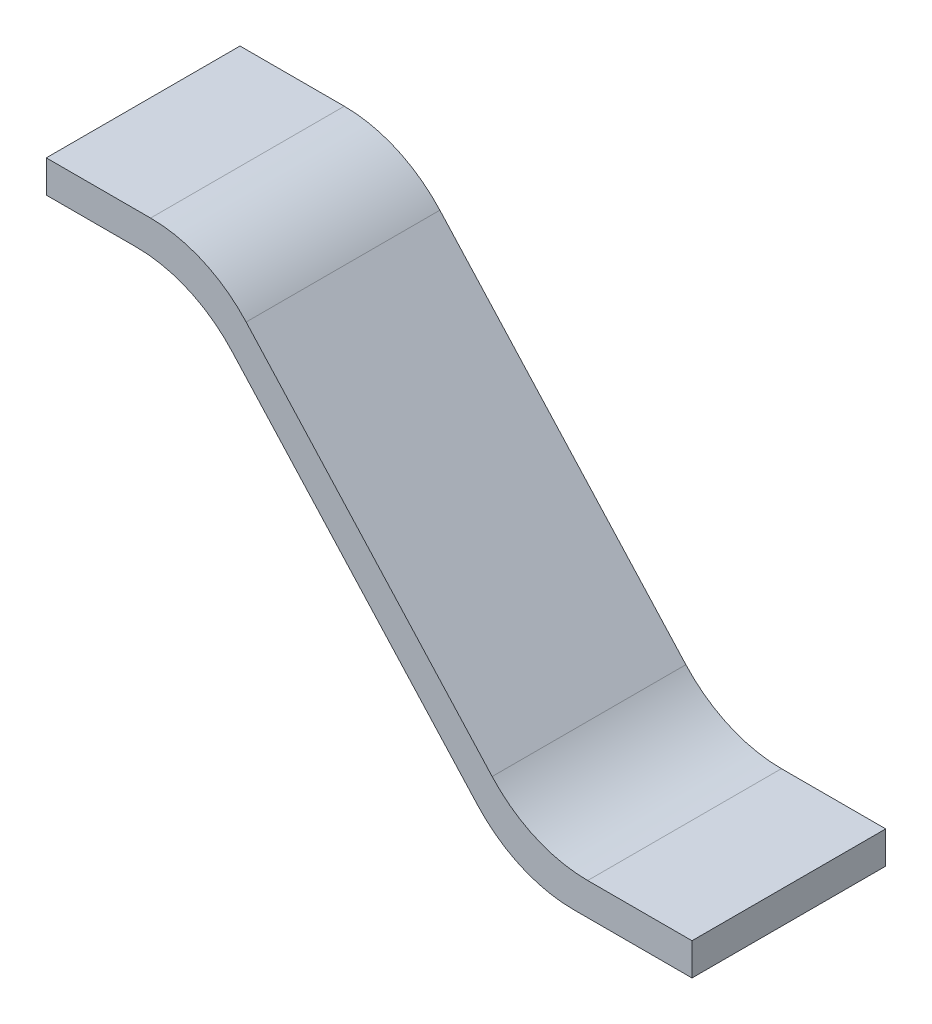
ISO-10303-21;
HEADER;
FILE_DESCRIPTION(('STEP AP214'),'2;1');
FILE_NAME('part.step','',(''),(''),'','','');
FILE_SCHEMA(('AUTOMOTIVE_DESIGN { 1 0 10303 214 1 1 1 1 }'));
ENDSEC;
DATA;
#1=APPLICATION_CONTEXT('core data for automotive mechanical design processes');
#2=APPLICATION_PROTOCOL_DEFINITION('international standard','automotive_design',2000,#1);
#3=PRODUCT_CONTEXT('',#1,'mechanical');
#4=PRODUCT('Part','Part','',(#3));
#5=PRODUCT_RELATED_PRODUCT_CATEGORY('part','',(#4));
#6=PRODUCT_DEFINITION_FORMATION('','',#4);
#7=PRODUCT_DEFINITION_CONTEXT('part definition',#1,'design');
#8=PRODUCT_DEFINITION('design','',#6,#7);
#9=PRODUCT_DEFINITION_SHAPE('','',#8);
#10=(LENGTH_UNIT() NAMED_UNIT(*) SI_UNIT(.MILLI.,.METRE.));
#11=(NAMED_UNIT(*) PLANE_ANGLE_UNIT() SI_UNIT($,.RADIAN.));
#12=(NAMED_UNIT(*) SI_UNIT($,.STERADIAN.) SOLID_ANGLE_UNIT());
#13=UNCERTAINTY_MEASURE_WITH_UNIT(LENGTH_MEASURE(1.E-05),#10,'distance_accuracy_value','');
#14=(GEOMETRIC_REPRESENTATION_CONTEXT(3) GLOBAL_UNCERTAINTY_ASSIGNED_CONTEXT((#13)) GLOBAL_UNIT_ASSIGNED_CONTEXT((#10,
#11,#12)) REPRESENTATION_CONTEXT('',''));
#15=CARTESIAN_POINT('',(0.,0.,0.));
#16=DIRECTION('',(0.,0.,1.));
#17=DIRECTION('',(1.,0.,0.));
#18=AXIS2_PLACEMENT_3D('',#15,#16,#17);
#19=CARTESIAN_POINT('',(0.,-0.05,0.15));
#20=DIRECTION('',(1.,0.,0.));
#21=DIRECTION('',(0.,0.,-1.));
#22=AXIS2_PLACEMENT_3D('',#19,#20,#21);
#23=PLANE('',#22);
#24=DIRECTION('',(0.,-1.,0.));
#25=VECTOR('',#24,1.);
#26=CARTESIAN_POINT('',(0.,-0.05,-0.15));
#27=LINE('',#26,#25);
#28=CARTESIAN_POINT('',(0.,0.,-0.15));
#29=VERTEX_POINT('',#28);
#30=CARTESIAN_POINT('',(0.,-0.05,-0.15));
#31=VERTEX_POINT('',#30);
#32=EDGE_CURVE('E147',#29,#31,#27,.T.);
#33=ORIENTED_EDGE('',*,*,#32,.T.);
#34=DIRECTION('',(0.,0.,-1.));
#35=VECTOR('',#34,1.);
#36=CARTESIAN_POINT('',(0.,-0.05,0.15));
#37=LINE('',#36,#35);
#38=CARTESIAN_POINT('',(0.,-0.05,0.15));
#39=VERTEX_POINT('',#38);
#40=EDGE_CURVE('E129',#39,#31,#37,.T.);
#41=ORIENTED_EDGE('',*,*,#40,.F.);
#42=DIRECTION('',(0.,-1.,0.));
#43=VECTOR('',#42,1.);
#44=CARTESIAN_POINT('',(0.,-0.05,0.15));
#45=LINE('',#44,#43);
#46=CARTESIAN_POINT('',(0.,0.,0.15));
#47=VERTEX_POINT('',#46);
#48=EDGE_CURVE('E135',#47,#39,#45,.T.);
#49=ORIENTED_EDGE('',*,*,#48,.F.);
#50=DIRECTION('',(0.,0.,-1.));
#51=VECTOR('',#50,1.);
#52=CARTESIAN_POINT('',(0.,0.,0.15));
#53=LINE('',#52,#51);
#54=EDGE_CURVE('E209',#47,#29,#53,.T.);
#55=ORIENTED_EDGE('',*,*,#54,.T.);
#56=EDGE_LOOP('',(#33,#41,#49,#55));
#57=FACE_BOUND('',#56,.T.);
#58=ADVANCED_FACE('F34',(#57),#23,.F.);
#59=CARTESIAN_POINT('',(0.,-0.05,0.15));
#60=DIRECTION('',(0.,1.,0.));
#61=DIRECTION('',(0.,0.,1.));
#62=AXIS2_PLACEMENT_3D('',#59,#60,#61);
#63=PLANE('',#62);
#64=DIRECTION('',(1.,0.,0.));
#65=VECTOR('',#64,1.);
#66=CARTESIAN_POINT('',(0.,-0.05,-0.15));
#67=LINE('',#66,#65);
#68=CARTESIAN_POINT('',(0.139407528470034,-0.05,-0.15));
#69=VERTEX_POINT('',#68);
#70=EDGE_CURVE('E216',#31,#69,#67,.T.);
#71=ORIENTED_EDGE('',*,*,#70,.T.);
#72=DIRECTION('',(0.,0.,-1.));
#73=VECTOR('',#72,1.);
#74=CARTESIAN_POINT('',(0.139407528470034,-0.05,0.15));
#75=LINE('',#74,#73);
#76=CARTESIAN_POINT('',(0.139407528470034,-0.05,0.15));
#77=VERTEX_POINT('',#76);
#78=EDGE_CURVE('E132',#69,#77,#75,.F.);
#79=ORIENTED_EDGE('',*,*,#78,.T.);
#80=DIRECTION('',(1.,0.,0.));
#81=VECTOR('',#80,1.);
#82=CARTESIAN_POINT('',(0.,-0.05,0.15));
#83=LINE('',#82,#81);
#84=EDGE_CURVE('E124',#39,#77,#83,.T.);
#85=ORIENTED_EDGE('',*,*,#84,.F.);
#86=ORIENTED_EDGE('',*,*,#40,.T.);
#87=EDGE_LOOP('',(#71,#79,#85,#86));
#88=FACE_BOUND('',#87,.T.);
#89=ADVANCED_FACE('F127',(#88),#63,.F.);
#90=CARTESIAN_POINT('',(0.227881505694007,-0.05,0.15));
#91=DIRECTION('',(0.739940073395944,0.672672793996313,0.));
#92=DIRECTION('',(-0.672672793996313,0.739940073395944,0.));
#93=AXIS2_PLACEMENT_3D('',#90,#91,#92);
#94=PLANE('',#93);
#95=DIRECTION('',(0.672672793996313,-0.739940073395944,0.));
#96=VECTOR('',#95,1.);
#97=CARTESIAN_POINT('',(0.227881505694007,-0.05,0.15));
#98=LINE('',#97,#96);
#99=CARTESIAN_POINT('',(0.287395543149223,-0.115465441200738,0.15));
#100=VERTEX_POINT('',#99);
#101=CARTESIAN_POINT('',(0.668367468238791,-0.534534558799262,0.15));
#102=VERTEX_POINT('',#101);
#103=EDGE_CURVE('E134',#100,#102,#98,.T.);
#104=ORIENTED_EDGE('',*,*,#103,.F.);
#105=DIRECTION('',(0.,0.,-1.));
#106=VECTOR('',#105,1.);
#107=CARTESIAN_POINT('',(0.287395543149223,-0.115465441200738,-0.15));
#108=LINE('',#107,#106);
#109=CARTESIAN_POINT('',(0.287395543149223,-0.115465441200738,-0.15));
#110=VERTEX_POINT('',#109);
#111=EDGE_CURVE('E151',#100,#110,#108,.T.);
#112=ORIENTED_EDGE('',*,*,#111,.T.);
#113=DIRECTION('',(0.672672793996313,-0.739940073395944,0.));
#114=VECTOR('',#113,1.);
#115=CARTESIAN_POINT('',(0.227881505694007,-0.05,-0.15));
#116=LINE('',#115,#114);
#117=CARTESIAN_POINT('',(0.668367468238791,-0.534534558799262,-0.15));
#118=VERTEX_POINT('',#117);
#119=EDGE_CURVE('E218',#110,#118,#116,.T.);
#120=ORIENTED_EDGE('',*,*,#119,.T.);
#121=DIRECTION('',(0.,0.,-1.));
#122=VECTOR('',#121,1.);
#123=CARTESIAN_POINT('',(0.668367468238791,-0.534534558799262,0.15));
#124=LINE('',#123,#122);
#125=EDGE_CURVE('E148',#118,#102,#124,.F.);
#126=ORIENTED_EDGE('',*,*,#125,.T.);
#127=EDGE_LOOP('',(#104,#112,#120,#126));
#128=FACE_BOUND('',#127,.T.);
#129=ADVANCED_FACE('F235',(#128),#94,.F.);
#130=CARTESIAN_POINT('',(0.727881505694007,-0.6,0.15));
#131=DIRECTION('',(0.,1.,0.));
#132=DIRECTION('',(0.,0.,1.));
#133=AXIS2_PLACEMENT_3D('',#130,#131,#132);
#134=PLANE('',#133);
#135=DIRECTION('',(1.,0.,0.));
#136=VECTOR('',#135,1.);
#137=CARTESIAN_POINT('',(0.727881505694007,-0.6,0.15));
#138=LINE('',#137,#136);
#139=CARTESIAN_POINT('',(0.81635548291798,-0.6,0.15));
#140=VERTEX_POINT('',#139);
#141=CARTESIAN_POINT('',(1.,-0.6,0.15));
#142=VERTEX_POINT('',#141);
#143=EDGE_CURVE('E237',#140,#142,#138,.T.);
#144=ORIENTED_EDGE('',*,*,#143,.F.);
#145=DIRECTION('',(0.,0.,-1.));
#146=VECTOR('',#145,1.);
#147=CARTESIAN_POINT('',(0.81635548291798,-0.6,0.15));
#148=LINE('',#147,#146);
#149=CARTESIAN_POINT('',(0.81635548291798,-0.6,-0.15));
#150=VERTEX_POINT('',#149);
#151=EDGE_CURVE('E161',#140,#150,#148,.T.);
#152=ORIENTED_EDGE('',*,*,#151,.T.);
#153=DIRECTION('',(1.,0.,0.));
#154=VECTOR('',#153,1.);
#155=CARTESIAN_POINT('',(0.727881505694007,-0.6,-0.15));
#156=LINE('',#155,#154);
#157=CARTESIAN_POINT('',(1.,-0.6,-0.15));
#158=VERTEX_POINT('',#157);
#159=EDGE_CURVE('E221',#150,#158,#156,.T.);
#160=ORIENTED_EDGE('',*,*,#159,.T.);
#161=DIRECTION('',(0.,0.,-1.));
#162=VECTOR('',#161,1.);
#163=CARTESIAN_POINT('',(1.,-0.6,0.15));
#164=LINE('',#163,#162);
#165=EDGE_CURVE('E149',#142,#158,#164,.T.);
#166=ORIENTED_EDGE('',*,*,#165,.F.);
#167=EDGE_LOOP('',(#144,#152,#160,#166));
#168=FACE_BOUND('',#167,.T.);
#169=ADVANCED_FACE('F246',(#168),#134,.F.);
#170=CARTESIAN_POINT('',(1.,-0.6,0.15));
#171=DIRECTION('',(-1.,0.,0.));
#172=DIRECTION('',(0.,0.,1.));
#173=AXIS2_PLACEMENT_3D('',#170,#171,#172);
#174=PLANE('',#173);
#175=DIRECTION('',(0.,1.,0.));
#176=VECTOR('',#175,1.);
#177=CARTESIAN_POINT('',(1.,-0.6,-0.15));
#178=LINE('',#177,#176);
#179=CARTESIAN_POINT('',(1.,-0.55,-0.15));
#180=VERTEX_POINT('',#179);
#181=EDGE_CURVE('E201',#158,#180,#178,.T.);
#182=ORIENTED_EDGE('',*,*,#181,.T.);
#183=DIRECTION('',(0.,0.,-1.));
#184=VECTOR('',#183,1.);
#185=CARTESIAN_POINT('',(1.,-0.55,0.15));
#186=LINE('',#185,#184);
#187=CARTESIAN_POINT('',(1.,-0.55,0.15));
#188=VERTEX_POINT('',#187);
#189=EDGE_CURVE('E154',#188,#180,#186,.T.);
#190=ORIENTED_EDGE('',*,*,#189,.F.);
#191=DIRECTION('',(0.,1.,0.));
#192=VECTOR('',#191,1.);
#193=CARTESIAN_POINT('',(1.,-0.6,0.15));
#194=LINE('',#193,#192);
#195=EDGE_CURVE('E211',#142,#188,#194,.T.);
#196=ORIENTED_EDGE('',*,*,#195,.F.);
#197=ORIENTED_EDGE('',*,*,#165,.T.);
#198=EDGE_LOOP('',(#182,#190,#196,#197));
#199=FACE_BOUND('',#198,.T.);
#200=ADVANCED_FACE('F244',(#199),#174,.F.);
#201=CARTESIAN_POINT('',(0.75,-0.55,0.15));
#202=DIRECTION('',(0.,-1.,0.));
#203=DIRECTION('',(0.,0.,-1.));
#204=AXIS2_PLACEMENT_3D('',#201,#202,#203);
#205=PLANE('',#204);
#206=DIRECTION('',(-1.,0.,0.));
#207=VECTOR('',#206,1.);
#208=CARTESIAN_POINT('',(0.75,-0.55,-0.15));
#209=LINE('',#208,#207);
#210=CARTESIAN_POINT('',(0.838473977223973,-0.55,-0.15));
#211=VERTEX_POINT('',#210);
#212=EDGE_CURVE('E190',#180,#211,#209,.T.);
#213=ORIENTED_EDGE('',*,*,#212,.T.);
#214=DIRECTION('',(0.,0.,-1.));
#215=VECTOR('',#214,1.);
#216=CARTESIAN_POINT('',(0.838473977223973,-0.55,0.15));
#217=LINE('',#216,#215);
#218=CARTESIAN_POINT('',(0.838473977223973,-0.55,0.15));
#219=VERTEX_POINT('',#218);
#220=EDGE_CURVE('E175',#211,#219,#217,.F.);
#221=ORIENTED_EDGE('',*,*,#220,.T.);
#222=DIRECTION('',(-1.,0.,0.));
#223=VECTOR('',#222,1.);
#224=CARTESIAN_POINT('',(0.75,-0.55,0.15));
#225=LINE('',#224,#223);
#226=EDGE_CURVE('E206',#188,#219,#225,.T.);
#227=ORIENTED_EDGE('',*,*,#226,.F.);
#228=ORIENTED_EDGE('',*,*,#189,.T.);
#229=EDGE_LOOP('',(#213,#221,#227,#228));
#230=FACE_BOUND('',#229,.T.);
#231=ADVANCED_FACE('F197',(#230),#205,.F.);
#232=CARTESIAN_POINT('',(0.25,0.,0.15));
#233=DIRECTION('',(-0.739940073395944,-0.672672793996313,0.));
#234=DIRECTION('',(0.672672793996313,-0.739940073395944,0.));
#235=AXIS2_PLACEMENT_3D('',#232,#233,#234);
#236=PLANE('',#235);
#237=DIRECTION('',(-0.672672793996313,0.739940073395944,0.));
#238=VECTOR('',#237,1.);
#239=CARTESIAN_POINT('',(0.25,0.,0.15));
#240=LINE('',#239,#238);
#241=CARTESIAN_POINT('',(0.690485962544784,-0.484534558799263,0.15));
#242=VERTEX_POINT('',#241);
#243=CARTESIAN_POINT('',(0.309514037455216,-0.0654654412007375,0.15));
#244=VERTEX_POINT('',#243);
#245=EDGE_CURVE('E205',#242,#244,#240,.T.);
#246=ORIENTED_EDGE('',*,*,#245,.F.);
#247=DIRECTION('',(0.,0.,-1.));
#248=VECTOR('',#247,1.);
#249=CARTESIAN_POINT('',(0.690485962544784,-0.484534558799262,-0.15));
#250=LINE('',#249,#248);
#251=CARTESIAN_POINT('',(0.690485962544784,-0.484534558799263,-0.15));
#252=VERTEX_POINT('',#251);
#253=EDGE_CURVE('E172',#242,#252,#250,.T.);
#254=ORIENTED_EDGE('',*,*,#253,.T.);
#255=DIRECTION('',(-0.672672793996313,0.739940073395944,0.));
#256=VECTOR('',#255,1.);
#257=CARTESIAN_POINT('',(0.25,0.,-0.15));
#258=LINE('',#257,#256);
#259=CARTESIAN_POINT('',(0.309514037455216,-0.0654654412007375,-0.15));
#260=VERTEX_POINT('',#259);
#261=EDGE_CURVE('E191',#252,#260,#258,.T.);
#262=ORIENTED_EDGE('',*,*,#261,.T.);
#263=DIRECTION('',(0.,0.,-1.));
#264=VECTOR('',#263,1.);
#265=CARTESIAN_POINT('',(0.309514037455216,-0.0654654412007375,0.15));
#266=LINE('',#265,#264);
#267=EDGE_CURVE('E57',#260,#244,#266,.F.);
#268=ORIENTED_EDGE('',*,*,#267,.T.);
#269=EDGE_LOOP('',(#246,#254,#262,#268));
#270=FACE_BOUND('',#269,.T.);
#271=ADVANCED_FACE('F207',(#270),#236,.F.);
#272=CARTESIAN_POINT('',(0.,0.,0.15));
#273=DIRECTION('',(0.,-1.,0.));
#274=DIRECTION('',(0.,0.,-1.));
#275=AXIS2_PLACEMENT_3D('',#272,#273,#274);
#276=PLANE('',#275);
#277=DIRECTION('',(-1.,0.,0.));
#278=VECTOR('',#277,1.);
#279=CARTESIAN_POINT('',(0.,0.,0.15));
#280=LINE('',#279,#278);
#281=CARTESIAN_POINT('',(0.161526022776027,0.,0.15));
#282=VERTEX_POINT('',#281);
#283=EDGE_CURVE('E140',#282,#47,#280,.T.);
#284=ORIENTED_EDGE('',*,*,#283,.F.);
#285=DIRECTION('',(0.,0.,-1.));
#286=VECTOR('',#285,1.);
#287=CARTESIAN_POINT('',(0.161526022776027,0.,0.15));
#288=LINE('',#287,#286);
#289=CARTESIAN_POINT('',(0.161526022776027,0.,-0.15));
#290=VERTEX_POINT('',#289);
#291=EDGE_CURVE('E177',#282,#290,#288,.T.);
#292=ORIENTED_EDGE('',*,*,#291,.T.);
#293=DIRECTION('',(-1.,0.,0.));
#294=VECTOR('',#293,1.);
#295=CARTESIAN_POINT('',(0.,0.,-0.15));
#296=LINE('',#295,#294);
#297=EDGE_CURVE('E144',#290,#29,#296,.T.);
#298=ORIENTED_EDGE('',*,*,#297,.T.);
#299=ORIENTED_EDGE('',*,*,#54,.F.);
#300=EDGE_LOOP('',(#284,#292,#298,#299));
#301=FACE_BOUND('',#300,.T.);
#302=ADVANCED_FACE('F274',(#301),#276,.F.);
#303=CARTESIAN_POINT('',(0.,0.,0.15));
#304=DIRECTION('',(0.,0.,-1.));
#305=DIRECTION('',(-1.,0.,0.));
#306=AXIS2_PLACEMENT_3D('',#303,#304,#305);
#307=PLANE('',#306);
#308=ORIENTED_EDGE('',*,*,#103,.T.);
#309=CARTESIAN_POINT('',(0.81635548291798,-0.4,0.15));
#310=DIRECTION('',(0.,0.,-1.));
#311=DIRECTION('',(-1.,0.,0.));
#312=AXIS2_PLACEMENT_3D('',#309,#310,#311);
#313=CIRCLE('',#312,0.2);
#314=EDGE_CURVE('E169',#102,#140,#313,.F.);
#315=ORIENTED_EDGE('',*,*,#314,.T.);
#316=ORIENTED_EDGE('',*,*,#143,.T.);
#317=ORIENTED_EDGE('',*,*,#195,.T.);
#318=ORIENTED_EDGE('',*,*,#226,.T.);
#319=CARTESIAN_POINT('',(0.838473977223973,-0.35,0.15));
#320=DIRECTION('',(0.,0.,-1.));
#321=DIRECTION('',(-1.,0.,0.));
#322=AXIS2_PLACEMENT_3D('',#319,#320,#321);
#323=CIRCLE('',#322,0.2);
#324=EDGE_CURVE('E11',#219,#242,#323,.T.);
#325=ORIENTED_EDGE('',*,*,#324,.T.);
#326=ORIENTED_EDGE('',*,*,#245,.T.);
#327=CARTESIAN_POINT('',(0.161526022776027,-0.2,0.15));
#328=DIRECTION('',(0.,0.,-1.));
#329=DIRECTION('',(-1.,0.,0.));
#330=AXIS2_PLACEMENT_3D('',#327,#328,#329);
#331=CIRCLE('',#330,0.2);
#332=EDGE_CURVE('E49',#244,#282,#331,.F.);
#333=ORIENTED_EDGE('',*,*,#332,.T.);
#334=ORIENTED_EDGE('',*,*,#283,.T.);
#335=ORIENTED_EDGE('',*,*,#48,.T.);
#336=ORIENTED_EDGE('',*,*,#84,.T.);
#337=CARTESIAN_POINT('',(0.139407528470034,-0.25,0.15));
#338=DIRECTION('',(0.,0.,-1.));
#339=DIRECTION('',(-1.,0.,0.));
#340=AXIS2_PLACEMENT_3D('',#337,#338,#339);
#341=CIRCLE('',#340,0.2);
#342=EDGE_CURVE('E182',#77,#100,#341,.T.);
#343=ORIENTED_EDGE('',*,*,#342,.T.);
#344=EDGE_LOOP('',(#308,#315,#316,#317,#318,#325,#326,#333,#334,#335,#336,#343));
#345=FACE_BOUND('',#344,.T.);
#346=ADVANCED_FACE('F139',(#345),#307,.F.);
#347=CARTESIAN_POINT('',(0.,0.,-0.15));
#348=DIRECTION('',(0.,0.,-1.));
#349=DIRECTION('',(-1.,0.,0.));
#350=AXIS2_PLACEMENT_3D('',#347,#348,#349);
#351=PLANE('',#350);
#352=ORIENTED_EDGE('',*,*,#159,.F.);
#353=CARTESIAN_POINT('',(0.81635548291798,-0.4,-0.15));
#354=DIRECTION('',(0.,0.,-1.));
#355=DIRECTION('',(-1.,0.,0.));
#356=AXIS2_PLACEMENT_3D('',#353,#354,#355);
#357=CIRCLE('',#356,0.2);
#358=EDGE_CURVE('E166',#150,#118,#357,.T.);
#359=ORIENTED_EDGE('',*,*,#358,.T.);
#360=ORIENTED_EDGE('',*,*,#119,.F.);
#361=CARTESIAN_POINT('',(0.139407528470034,-0.25,-0.15));
#362=DIRECTION('',(0.,0.,-1.));
#363=DIRECTION('',(-1.,0.,0.));
#364=AXIS2_PLACEMENT_3D('',#361,#362,#363);
#365=CIRCLE('',#364,0.2);
#366=EDGE_CURVE('E180',#110,#69,#365,.F.);
#367=ORIENTED_EDGE('',*,*,#366,.T.);
#368=ORIENTED_EDGE('',*,*,#70,.F.);
#369=ORIENTED_EDGE('',*,*,#32,.F.);
#370=ORIENTED_EDGE('',*,*,#297,.F.);
#371=CARTESIAN_POINT('',(0.161526022776027,-0.2,-0.15));
#372=DIRECTION('',(0.,0.,-1.));
#373=DIRECTION('',(-1.,0.,0.));
#374=AXIS2_PLACEMENT_3D('',#371,#372,#373);
#375=CIRCLE('',#374,0.2);
#376=EDGE_CURVE('E164',#290,#260,#375,.T.);
#377=ORIENTED_EDGE('',*,*,#376,.T.);
#378=ORIENTED_EDGE('',*,*,#261,.F.);
#379=CARTESIAN_POINT('',(0.838473977223973,-0.35,-0.15));
#380=DIRECTION('',(0.,0.,-1.));
#381=DIRECTION('',(-1.,0.,0.));
#382=AXIS2_PLACEMENT_3D('',#379,#380,#381);
#383=CIRCLE('',#382,0.2);
#384=EDGE_CURVE('E42',#252,#211,#383,.F.);
#385=ORIENTED_EDGE('',*,*,#384,.T.);
#386=ORIENTED_EDGE('',*,*,#212,.F.);
#387=ORIENTED_EDGE('',*,*,#181,.F.);
#388=EDGE_LOOP('',(#352,#359,#360,#367,#368,#369,#370,#377,#378,#385,#386,#387));
#389=FACE_BOUND('',#388,.T.);
#390=ADVANCED_FACE('F188',(#389),#351,.T.);
#391=CARTESIAN_POINT('',(0.139407528470034,-0.25,0.15));
#392=DIRECTION('',(0.,0.,1.));
#393=DIRECTION('',(1.,0.,0.));
#394=AXIS2_PLACEMENT_3D('',#391,#392,#393);
#395=CYLINDRICAL_SURFACE('',#394,0.2);
#396=ORIENTED_EDGE('',*,*,#342,.F.);
#397=ORIENTED_EDGE('',*,*,#78,.F.);
#398=ORIENTED_EDGE('',*,*,#366,.F.);
#399=ORIENTED_EDGE('',*,*,#111,.F.);
#400=EDGE_LOOP('',(#396,#397,#398,#399));
#401=FACE_BOUND('',#400,.T.);
#402=ADVANCED_FACE('F230',(#401),#395,.F.);
#403=CARTESIAN_POINT('',(0.81635548291798,-0.4,0.15));
#404=DIRECTION('',(0.,0.,-1.));
#405=DIRECTION('',(-1.,0.,0.));
#406=AXIS2_PLACEMENT_3D('',#403,#404,#405);
#407=CYLINDRICAL_SURFACE('',#406,0.2);
#408=ORIENTED_EDGE('',*,*,#314,.F.);
#409=ORIENTED_EDGE('',*,*,#125,.F.);
#410=ORIENTED_EDGE('',*,*,#358,.F.);
#411=ORIENTED_EDGE('',*,*,#151,.F.);
#412=EDGE_LOOP('',(#408,#409,#410,#411));
#413=FACE_BOUND('',#412,.T.);
#414=ADVANCED_FACE('F249',(#413),#407,.T.);
#415=CARTESIAN_POINT('',(0.838473977223973,-0.35,0.15));
#416=DIRECTION('',(0.,0.,1.));
#417=DIRECTION('',(1.,0.,0.));
#418=AXIS2_PLACEMENT_3D('',#415,#416,#417);
#419=CYLINDRICAL_SURFACE('',#418,0.2);
#420=ORIENTED_EDGE('',*,*,#324,.F.);
#421=ORIENTED_EDGE('',*,*,#220,.F.);
#422=ORIENTED_EDGE('',*,*,#384,.F.);
#423=ORIENTED_EDGE('',*,*,#253,.F.);
#424=EDGE_LOOP('',(#420,#421,#422,#423));
#425=FACE_BOUND('',#424,.T.);
#426=ADVANCED_FACE('F204',(#425),#419,.F.);
#427=CARTESIAN_POINT('',(0.161526022776027,-0.2,0.15));
#428=DIRECTION('',(0.,0.,-1.));
#429=DIRECTION('',(-1.,0.,0.));
#430=AXIS2_PLACEMENT_3D('',#427,#428,#429);
#431=CYLINDRICAL_SURFACE('',#430,0.2);
#432=ORIENTED_EDGE('',*,*,#332,.F.);
#433=ORIENTED_EDGE('',*,*,#267,.F.);
#434=ORIENTED_EDGE('',*,*,#376,.F.);
#435=ORIENTED_EDGE('',*,*,#291,.F.);
#436=EDGE_LOOP('',(#432,#433,#434,#435));
#437=FACE_BOUND('',#436,.T.);
#438=ADVANCED_FACE('F36',(#437),#431,.T.);
#439=CLOSED_SHELL('',(#58,#89,#129,#169,#200,#231,#271,#302,#346,#390,#402,#414,#426,#438));
#440=MANIFOLD_SOLID_BREP('B2',#439);
#441=ADVANCED_BREP_SHAPE_REPRESENTATION('',(#18,#440),#14);
#442=SHAPE_DEFINITION_REPRESENTATION(#9,#441);
ENDSEC;
END-ISO-10303-21;
